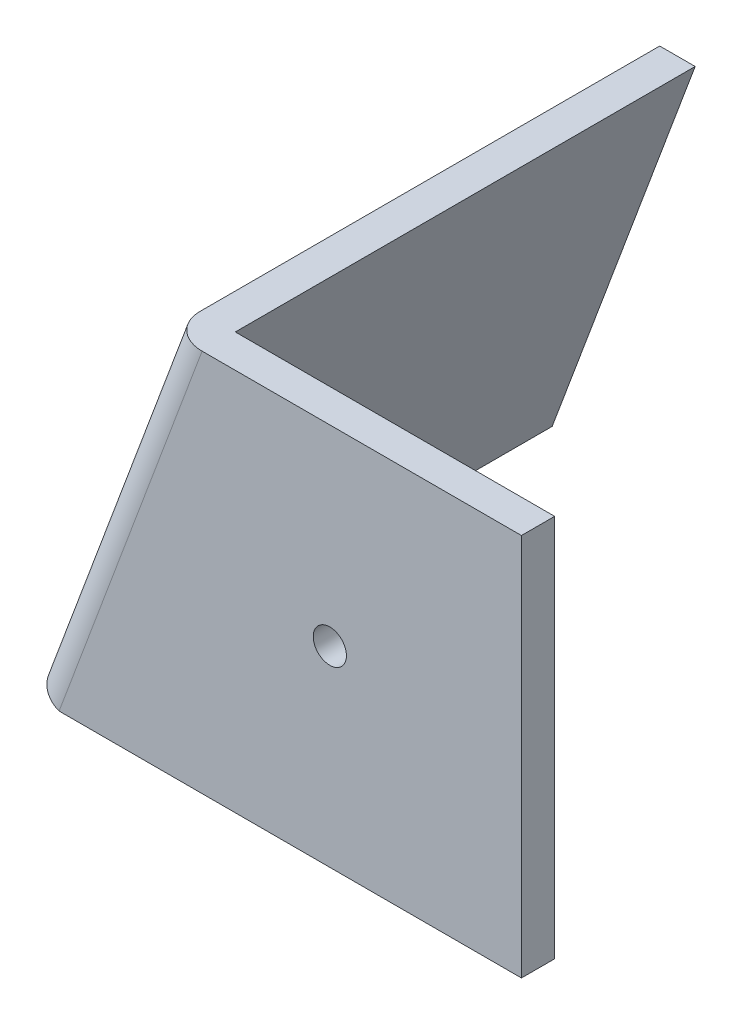
ISO-10303-21;
HEADER;
FILE_DESCRIPTION(('STEP AP214'),'2;1');
FILE_NAME('part.step','',(''),(''),'','','');
FILE_SCHEMA(('AUTOMOTIVE_DESIGN { 1 0 10303 214 1 1 1 1 }'));
ENDSEC;
DATA;
#1=APPLICATION_CONTEXT('core data for automotive mechanical design processes');
#2=APPLICATION_PROTOCOL_DEFINITION('international standard','automotive_design',2000,#1);
#3=PRODUCT_CONTEXT('',#1,'mechanical');
#4=PRODUCT('Part','Part','',(#3));
#5=PRODUCT_RELATED_PRODUCT_CATEGORY('part','',(#4));
#6=PRODUCT_DEFINITION_FORMATION('','',#4);
#7=PRODUCT_DEFINITION_CONTEXT('part definition',#1,'design');
#8=PRODUCT_DEFINITION('design','',#6,#7);
#9=PRODUCT_DEFINITION_SHAPE('','',#8);
#10=(LENGTH_UNIT() NAMED_UNIT(*) SI_UNIT(.MILLI.,.METRE.));
#11=(NAMED_UNIT(*) PLANE_ANGLE_UNIT() SI_UNIT($,.RADIAN.));
#12=(NAMED_UNIT(*) SI_UNIT($,.STERADIAN.) SOLID_ANGLE_UNIT());
#13=UNCERTAINTY_MEASURE_WITH_UNIT(LENGTH_MEASURE(1.E-05),#10,'distance_accuracy_value','');
#14=(GEOMETRIC_REPRESENTATION_CONTEXT(3) GLOBAL_UNCERTAINTY_ASSIGNED_CONTEXT((#13)) GLOBAL_UNIT_ASSIGNED_CONTEXT((#10,
#11,#12)) REPRESENTATION_CONTEXT('',''));
#15=CARTESIAN_POINT('',(0.,0.,0.));
#16=DIRECTION('',(0.,0.,1.));
#17=DIRECTION('',(1.,0.,0.));
#18=AXIS2_PLACEMENT_3D('',#15,#16,#17);
#19=CARTESIAN_POINT('',(-31.75,0.,-3.302));
#20=DIRECTION('',(0.,1.,0.));
#21=DIRECTION('',(0.,0.,1.));
#22=AXIS2_PLACEMENT_3D('',#19,#20,#21);
#23=PLANE('',#22);
#24=DIRECTION('',(-1.,0.,0.));
#25=VECTOR('',#24,1.);
#26=CARTESIAN_POINT('',(-31.75,0.,0.));
#27=LINE('',#26,#25);
#28=CARTESIAN_POINT('',(0.,0.,0.));
#29=VERTEX_POINT('',#28);
#30=CARTESIAN_POINT('',(-31.75,0.,0.));
#31=VERTEX_POINT('',#30);
#32=EDGE_CURVE('E128',#29,#31,#27,.T.);
#33=ORIENTED_EDGE('',*,*,#32,.F.);
#34=DIRECTION('',(0.,0.,1.));
#35=VECTOR('',#34,1.);
#36=CARTESIAN_POINT('',(0.,0.,-3.302));
#37=LINE('',#36,#35);
#38=CARTESIAN_POINT('',(0.,0.,-3.302));
#39=VERTEX_POINT('',#38);
#40=EDGE_CURVE('E11',#39,#29,#37,.T.);
#41=ORIENTED_EDGE('',*,*,#40,.F.);
#42=DIRECTION('',(-1.,0.,0.));
#43=VECTOR('',#42,1.);
#44=CARTESIAN_POINT('',(-31.75,0.,-3.302));
#45=LINE('',#44,#43);
#46=CARTESIAN_POINT('',(-31.75,0.,-3.302));
#47=VERTEX_POINT('',#46);
#48=EDGE_CURVE('E90',#39,#47,#45,.T.);
#49=ORIENTED_EDGE('',*,*,#48,.T.);
#50=DIRECTION('',(0.,0.,1.));
#51=VECTOR('',#50,1.);
#52=CARTESIAN_POINT('',(-31.75,0.,-3.302));
#53=LINE('',#52,#51);
#54=CARTESIAN_POINT('',(-31.75,0.,-49.022));
#55=VERTEX_POINT('',#54);
#56=EDGE_CURVE('E127',#55,#47,#53,.T.);
#57=ORIENTED_EDGE('',*,*,#56,.F.);
#58=DIRECTION('',(-1.,0.,0.));
#59=VECTOR('',#58,1.);
#60=CARTESIAN_POINT('',(-34.8436981239822,0.,-49.022));
#61=LINE('',#60,#59);
#62=CARTESIAN_POINT('',(-35.2743270555326,0.,-49.022));
#63=VERTEX_POINT('',#62);
#64=EDGE_CURVE('E157',#55,#63,#61,.T.);
#65=ORIENTED_EDGE('',*,*,#64,.T.);
#66=DIRECTION('',(0.,0.,1.));
#67=VECTOR('',#66,1.);
#68=CARTESIAN_POINT('',(-35.2743270555326,0.,-56.896));
#69=LINE('',#68,#67);
#70=CARTESIAN_POINT('',(-35.2743270555326,0.,-3.302));
#71=VERTEX_POINT('',#70);
#72=EDGE_CURVE('E151',#63,#71,#69,.T.);
#73=ORIENTED_EDGE('',*,*,#72,.T.);
#74=CARTESIAN_POINT('',(-31.75,0.,-3.302));
#75=DIRECTION('',(0.,-1.,0.));
#76=DIRECTION('',(-1.,0.,0.));
#77=AXIS2_PLACEMENT_3D('',#74,#75,#76);
#78=ELLIPSE('',#77,3.5243270555325,3.302);
#79=EDGE_CURVE('E123',#31,#71,#78,.T.);
#80=ORIENTED_EDGE('',*,*,#79,.F.);
#81=EDGE_LOOP('',(#33,#41,#49,#57,#65,#73,#80));
#82=FACE_BOUND('',#81,.T.);
#83=ADVANCED_FACE('F39',(#82),#23,.T.);
#84=CARTESIAN_POINT('',(0.,-38.1,-3.302));
#85=DIRECTION('',(1.,0.,0.));
#86=DIRECTION('',(0.,0.,-1.));
#87=AXIS2_PLACEMENT_3D('',#84,#85,#86);
#88=PLANE('',#87);
#89=DIRECTION('',(0.,1.,0.));
#90=VECTOR('',#89,1.);
#91=CARTESIAN_POINT('',(0.,-38.1,0.));
#92=LINE('',#91,#90);
#93=CARTESIAN_POINT('',(0.,-38.1,0.));
#94=VERTEX_POINT('',#93);
#95=EDGE_CURVE('E130',#94,#29,#92,.T.);
#96=ORIENTED_EDGE('',*,*,#95,.F.);
#97=DIRECTION('',(0.,0.,1.));
#98=VECTOR('',#97,1.);
#99=CARTESIAN_POINT('',(0.,-38.1,-3.302));
#100=LINE('',#99,#98);
#101=CARTESIAN_POINT('',(0.,-38.1,-3.302));
#102=VERTEX_POINT('',#101);
#103=EDGE_CURVE('E49',#102,#94,#100,.T.);
#104=ORIENTED_EDGE('',*,*,#103,.F.);
#105=DIRECTION('',(0.,1.,0.));
#106=VECTOR('',#105,1.);
#107=CARTESIAN_POINT('',(0.,-38.1,-3.302));
#108=LINE('',#107,#106);
#109=EDGE_CURVE('E100',#102,#39,#108,.T.);
#110=ORIENTED_EDGE('',*,*,#109,.T.);
#111=ORIENTED_EDGE('',*,*,#40,.T.);
#112=EDGE_LOOP('',(#96,#104,#110,#111));
#113=FACE_BOUND('',#112,.T.);
#114=ADVANCED_FACE('F191',(#113),#88,.T.);
#115=CARTESIAN_POINT('',(-45.9646971347795,-38.1,-3.302));
#116=DIRECTION('',(0.,-1.,0.));
#117=DIRECTION('',(0.,0.,-1.));
#118=AXIS2_PLACEMENT_3D('',#115,#116,#117);
#119=PLANE('',#118);
#120=DIRECTION('',(1.,0.,0.));
#121=VECTOR('',#120,1.);
#122=CARTESIAN_POINT('',(-45.9646971347795,-38.1,0.));
#123=LINE('',#122,#121);
#124=CARTESIAN_POINT('',(-45.9646971347795,-38.1,0.));
#125=VERTEX_POINT('',#124);
#126=EDGE_CURVE('E85',#125,#94,#123,.T.);
#127=ORIENTED_EDGE('',*,*,#126,.F.);
#128=DIRECTION('',(0.,0.,1.));
#129=VECTOR('',#128,1.);
#130=CARTESIAN_POINT('',(-45.9646971347795,-38.1,-3.302));
#131=LINE('',#130,#129);
#132=CARTESIAN_POINT('',(-45.9646971347795,-38.1,-3.302));
#133=VERTEX_POINT('',#132);
#134=EDGE_CURVE('E43',#133,#125,#131,.T.);
#135=ORIENTED_EDGE('',*,*,#134,.F.);
#136=DIRECTION('',(1.,0.,0.));
#137=VECTOR('',#136,1.);
#138=CARTESIAN_POINT('',(-45.9646971347795,-38.1,-3.302));
#139=LINE('',#138,#137);
#140=EDGE_CURVE('E84',#133,#102,#139,.T.);
#141=ORIENTED_EDGE('',*,*,#140,.T.);
#142=ORIENTED_EDGE('',*,*,#103,.T.);
#143=EDGE_LOOP('',(#127,#135,#141,#142));
#144=FACE_BOUND('',#143,.T.);
#145=ADVANCED_FACE('F41',(#144),#119,.T.);
#146=CARTESIAN_POINT('',(0.,0.,-3.302));
#147=DIRECTION('',(0.,0.,1.));
#148=DIRECTION('',(1.,0.,0.));
#149=AXIS2_PLACEMENT_3D('',#146,#147,#148);
#150=PLANE('',#149);
#151=CARTESIAN_POINT('',(-19.05,-19.05,-3.302));
#152=DIRECTION('',(0.,0.,1.));
#153=DIRECTION('',(1.,0.,0.));
#154=AXIS2_PLACEMENT_3D('',#151,#152,#153);
#155=CIRCLE('',#154,1.651);
#156=CARTESIAN_POINT('',(-17.399,-19.05,-3.302));
#157=VERTEX_POINT('',#156);
#158=EDGE_CURVE('E139',#157,#157,#155,.T.);
#159=ORIENTED_EDGE('',*,*,#158,.T.);
#160=EDGE_LOOP('',(#159));
#161=FACE_BOUND('',#160,.T.);
#162=DIRECTION('',(-0.349553375420609,-0.936916451841923,0.));
#163=VECTOR('',#162,1.);
#164=CARTESIAN_POINT('',(-31.75,0.,-3.302));
#165=LINE('',#164,#163);
#166=EDGE_CURVE('E98',#47,#133,#165,.T.);
#167=ORIENTED_EDGE('',*,*,#166,.F.);
#168=ORIENTED_EDGE('',*,*,#48,.F.);
#169=ORIENTED_EDGE('',*,*,#109,.F.);
#170=ORIENTED_EDGE('',*,*,#140,.F.);
#171=EDGE_LOOP('',(#167,#168,#169,#170));
#172=FACE_BOUND('',#171,.T.);
#173=ADVANCED_FACE('F94',(#161,#172),#150,.F.);
#174=CARTESIAN_POINT('',(0.,0.,0.));
#175=DIRECTION('',(0.,0.,1.));
#176=DIRECTION('',(1.,0.,0.));
#177=AXIS2_PLACEMENT_3D('',#174,#175,#176);
#178=PLANE('',#177);
#179=CARTESIAN_POINT('',(-19.05,-19.05,0.));
#180=DIRECTION('',(0.,0.,1.));
#181=DIRECTION('',(1.,0.,0.));
#182=AXIS2_PLACEMENT_3D('',#179,#180,#181);
#183=CIRCLE('',#182,1.651);
#184=CARTESIAN_POINT('',(-17.399,-19.05,0.));
#185=VERTEX_POINT('',#184);
#186=EDGE_CURVE('E133',#185,#185,#183,.T.);
#187=ORIENTED_EDGE('',*,*,#186,.F.);
#188=EDGE_LOOP('',(#187));
#189=FACE_BOUND('',#188,.T.);
#190=DIRECTION('',(-0.349553375420609,-0.936916451841923,0.));
#191=VECTOR('',#190,1.);
#192=CARTESIAN_POINT('',(-31.75,0.,0.));
#193=LINE('',#192,#191);
#194=EDGE_CURVE('E76',#31,#125,#193,.T.);
#195=ORIENTED_EDGE('',*,*,#194,.T.);
#196=ORIENTED_EDGE('',*,*,#126,.T.);
#197=ORIENTED_EDGE('',*,*,#95,.T.);
#198=ORIENTED_EDGE('',*,*,#32,.T.);
#199=EDGE_LOOP('',(#195,#196,#197,#198));
#200=FACE_BOUND('',#199,.T.);
#201=ADVANCED_FACE('F142',(#189,#200),#178,.T.);
#202=CARTESIAN_POINT('',(-19.05,-19.05,-3.302));
#203=DIRECTION('',(0.,0.,1.));
#204=DIRECTION('',(1.,0.,0.));
#205=AXIS2_PLACEMENT_3D('',#202,#203,#204);
#206=CYLINDRICAL_SURFACE('',#205,1.651);
#207=ORIENTED_EDGE('',*,*,#158,.F.);
#208=EDGE_LOOP('',(#207));
#209=FACE_BOUND('',#208,.T.);
#210=ORIENTED_EDGE('',*,*,#186,.T.);
#211=EDGE_LOOP('',(#210));
#212=FACE_BOUND('',#211,.T.);
#213=ADVANCED_FACE('F177',(#209,#212),#206,.F.);
#214=CARTESIAN_POINT('',(-45.9646971347795,-38.1,-3.302));
#215=DIRECTION('',(-0.349553375420609,-0.936916451841923,0.));
#216=DIRECTION('',(0.936916451841923,-0.349553375420609,0.));
#217=AXIS2_PLACEMENT_3D('',#214,#215,#216);
#218=CYLINDRICAL_SURFACE('',#217,3.302);
#219=ORIENTED_EDGE('',*,*,#194,.F.);
#220=ORIENTED_EDGE('',*,*,#79,.T.);
#221=DIRECTION('',(-0.349553375420609,-0.936916451841923,0.));
#222=VECTOR('',#221,1.);
#223=CARTESIAN_POINT('',(-49.0583952587616,-36.9457747543611,-3.30199999999999));
#224=LINE('',#223,#222);
#225=CARTESIAN_POINT('',(-49.0583952587616,-36.9457747543611,-3.30199999999999));
#226=VERTEX_POINT('',#225);
#227=EDGE_CURVE('E162',#71,#226,#224,.T.);
#228=ORIENTED_EDGE('',*,*,#227,.T.);
#229=CARTESIAN_POINT('',(-45.9646971347795,-38.1,-3.302));
#230=DIRECTION('',(-0.349553375420609,-0.936916451841923,0.));
#231=DIRECTION('',(0.936916451841923,-0.349553375420609,0.));
#232=AXIS2_PLACEMENT_3D('',#229,#230,#231);
#233=CIRCLE('',#232,3.302);
#234=EDGE_CURVE('E106',#125,#226,#233,.T.);
#235=ORIENTED_EDGE('',*,*,#234,.F.);
#236=EDGE_LOOP('',(#219,#220,#228,#235));
#237=FACE_BOUND('',#236,.T.);
#238=ADVANCED_FACE('F185',(#237),#218,.T.);
#239=CARTESIAN_POINT('',(-45.9646971347795,-38.1,0.));
#240=DIRECTION('',(0.349553375420609,0.936916451841923,0.));
#241=DIRECTION('',(-0.936916451841923,0.349553375420609,0.));
#242=AXIS2_PLACEMENT_3D('',#239,#240,#241);
#243=PLANE('',#242);
#244=ORIENTED_EDGE('',*,*,#134,.T.);
#245=ORIENTED_EDGE('',*,*,#234,.T.);
#246=DIRECTION('',(0.936916451841923,-0.349553375420609,0.));
#247=VECTOR('',#246,1.);
#248=CARTESIAN_POINT('',(-49.0583952587616,-36.9457747543611,-3.30199999999999));
#249=LINE('',#248,#247);
#250=EDGE_CURVE('E103',#226,#133,#249,.T.);
#251=ORIENTED_EDGE('',*,*,#250,.T.);
#252=EDGE_LOOP('',(#244,#245,#251));
#253=FACE_BOUND('',#252,.T.);
#254=ADVANCED_FACE('F105',(#253),#243,.F.);
#255=CARTESIAN_POINT('',(-34.8436981239822,1.15422524563891,-49.022));
#256=DIRECTION('',(0.,0.,-1.));
#257=DIRECTION('',(-1.,0.,0.));
#258=AXIS2_PLACEMENT_3D('',#255,#256,#257);
#259=PLANE('',#258);
#260=ORIENTED_EDGE('',*,*,#64,.F.);
#261=DIRECTION('',(0.349553375420608,0.936916451841923,0.));
#262=VECTOR('',#261,1.);
#263=CARTESIAN_POINT('',(-31.7500000000002,0.,-49.022));
#264=LINE('',#263,#262);
#265=CARTESIAN_POINT('',(-45.9646971347797,-38.0999999999999,-49.022));
#266=VERTEX_POINT('',#265);
#267=EDGE_CURVE('E122',#266,#55,#264,.T.);
#268=ORIENTED_EDGE('',*,*,#267,.F.);
#269=DIRECTION('',(0.936916451841923,-0.349553375420609,0.));
#270=VECTOR('',#269,1.);
#271=CARTESIAN_POINT('',(-49.0583952587617,-36.9457747543611,-49.022));
#272=LINE('',#271,#270);
#273=CARTESIAN_POINT('',(-49.0583952587617,-36.9457747543611,-49.022));
#274=VERTEX_POINT('',#273);
#275=EDGE_CURVE('E110',#274,#266,#272,.T.);
#276=ORIENTED_EDGE('',*,*,#275,.F.);
#277=DIRECTION('',(0.349553375420608,0.936916451841923,0.));
#278=VECTOR('',#277,1.);
#279=CARTESIAN_POINT('',(-34.8436981239822,1.15422524563891,-49.022));
#280=LINE('',#279,#278);
#281=EDGE_CURVE('E111',#274,#63,#280,.T.);
#282=ORIENTED_EDGE('',*,*,#281,.T.);
#283=EDGE_LOOP('',(#260,#268,#276,#282));
#284=FACE_BOUND('',#283,.T.);
#285=ADVANCED_FACE('F232',(#284),#259,.T.);
#286=CARTESIAN_POINT('',(-49.0583952587617,-36.9457747543611,-49.022));
#287=DIRECTION('',(-0.349553375420609,-0.936916451841923,0.));
#288=DIRECTION('',(0.936916451841923,-0.349553375420609,0.));
#289=AXIS2_PLACEMENT_3D('',#286,#287,#288);
#290=PLANE('',#289);
#291=DIRECTION('',(0.,0.,-1.));
#292=VECTOR('',#291,1.);
#293=CARTESIAN_POINT('',(-45.9646971347797,-38.0999999999999,-49.022));
#294=LINE('',#293,#292);
#295=EDGE_CURVE('E115',#133,#266,#294,.T.);
#296=ORIENTED_EDGE('',*,*,#295,.F.);
#297=ORIENTED_EDGE('',*,*,#250,.F.);
#298=DIRECTION('',(0.,0.,-1.));
#299=VECTOR('',#298,1.);
#300=CARTESIAN_POINT('',(-49.0583952587617,-36.9457747543611,-49.022));
#301=LINE('',#300,#299);
#302=EDGE_CURVE('E164',#226,#274,#301,.T.);
#303=ORIENTED_EDGE('',*,*,#302,.T.);
#304=ORIENTED_EDGE('',*,*,#275,.T.);
#305=EDGE_LOOP('',(#296,#297,#303,#304));
#306=FACE_BOUND('',#305,.T.);
#307=ADVANCED_FACE('F116',(#306),#290,.T.);
#308=CARTESIAN_POINT('',(-30.9642430219749,11.552423531892,1.17211560523651E-13));
#309=DIRECTION('',(-0.936916451841923,0.349553375420609,0.));
#310=DIRECTION('',(-0.349553375420609,-0.936916451841923,0.));
#311=AXIS2_PLACEMENT_3D('',#308,#309,#310);
#312=PLANE('',#311);
#313=ORIENTED_EDGE('',*,*,#72,.F.);
#314=ORIENTED_EDGE('',*,*,#281,.F.);
#315=ORIENTED_EDGE('',*,*,#302,.F.);
#316=ORIENTED_EDGE('',*,*,#227,.F.);
#317=EDGE_LOOP('',(#313,#314,#315,#316));
#318=FACE_BOUND('',#317,.T.);
#319=ADVANCED_FACE('F245',(#318),#312,.T.);
#320=CARTESIAN_POINT('',(-27.8705448979929,10.3981982862531,1.05682689142791E-13));
#321=DIRECTION('',(-0.936916451841923,0.349553375420609,0.));
#322=DIRECTION('',(-0.349553375420609,-0.936916451841923,0.));
#323=AXIS2_PLACEMENT_3D('',#320,#321,#322);
#324=PLANE('',#323);
#325=ORIENTED_EDGE('',*,*,#166,.T.);
#326=ORIENTED_EDGE('',*,*,#295,.T.);
#327=ORIENTED_EDGE('',*,*,#267,.T.);
#328=ORIENTED_EDGE('',*,*,#56,.T.);
#329=EDGE_LOOP('',(#325,#326,#327,#328));
#330=FACE_BOUND('',#329,.T.);
#331=ADVANCED_FACE('F125',(#330),#324,.F.);
#332=CLOSED_SHELL('',(#83,#114,#145,#173,#201,#213,#238,#254,#285,#307,#319,#331));
#333=MANIFOLD_SOLID_BREP('B2',#332);
#334=ADVANCED_BREP_SHAPE_REPRESENTATION('',(#18,#333),#14);
#335=SHAPE_DEFINITION_REPRESENTATION(#9,#334);
ENDSEC;
END-ISO-10303-21;
